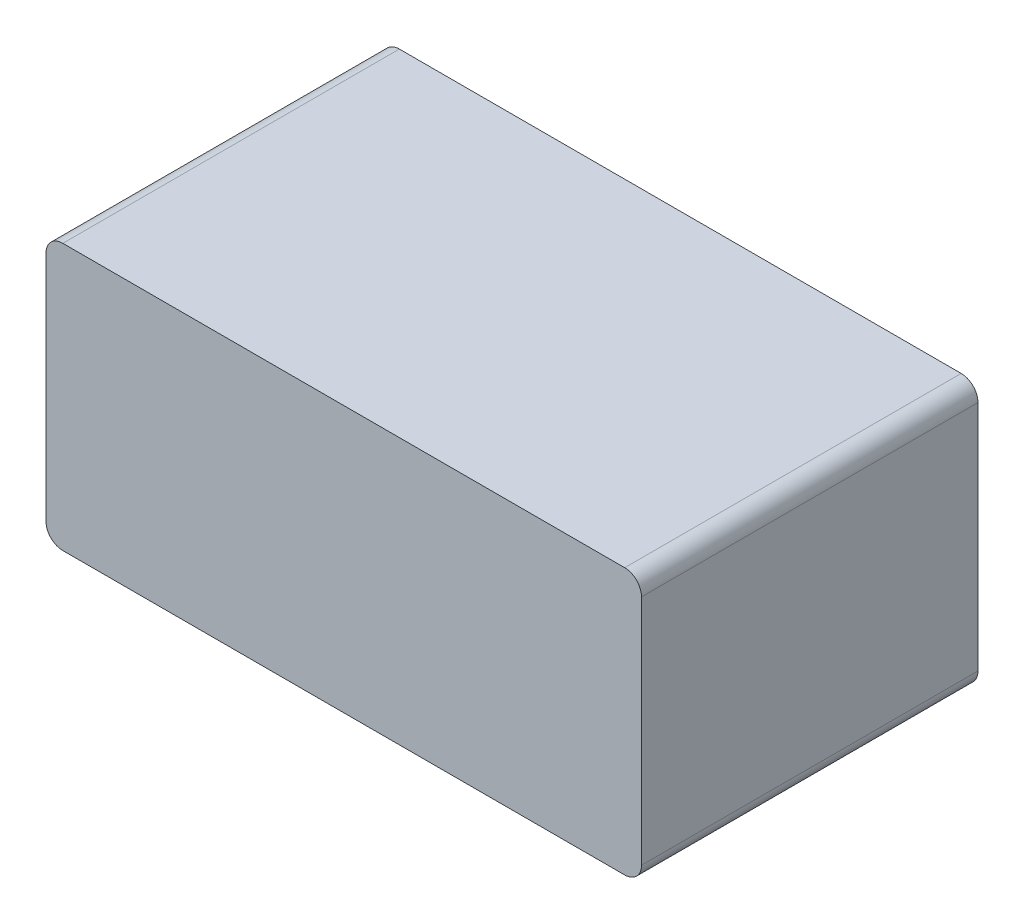
ISO-10303-21;
HEADER;
FILE_DESCRIPTION(('STEP AP214'),'2;1');
FILE_NAME('part.step','',(''),(''),'','','');
FILE_SCHEMA(('AUTOMOTIVE_DESIGN { 1 0 10303 214 1 1 1 1 }'));
ENDSEC;
DATA;
#1=APPLICATION_CONTEXT('core data for automotive mechanical design processes');
#2=APPLICATION_PROTOCOL_DEFINITION('international standard','automotive_design',2000,#1);
#3=PRODUCT_CONTEXT('',#1,'mechanical');
#4=PRODUCT('Part','Part','',(#3));
#5=PRODUCT_RELATED_PRODUCT_CATEGORY('part','',(#4));
#6=PRODUCT_DEFINITION_FORMATION('','',#4);
#7=PRODUCT_DEFINITION_CONTEXT('part definition',#1,'design');
#8=PRODUCT_DEFINITION('design','',#6,#7);
#9=PRODUCT_DEFINITION_SHAPE('','',#8);
#10=(LENGTH_UNIT() NAMED_UNIT(*) SI_UNIT(.MILLI.,.METRE.));
#11=(NAMED_UNIT(*) PLANE_ANGLE_UNIT() SI_UNIT($,.RADIAN.));
#12=(NAMED_UNIT(*) SI_UNIT($,.STERADIAN.) SOLID_ANGLE_UNIT());
#13=UNCERTAINTY_MEASURE_WITH_UNIT(LENGTH_MEASURE(1.E-05),#10,'distance_accuracy_value','');
#14=(GEOMETRIC_REPRESENTATION_CONTEXT(3) GLOBAL_UNCERTAINTY_ASSIGNED_CONTEXT((#13)) GLOBAL_UNIT_ASSIGNED_CONTEXT((#10,
#11,#12)) REPRESENTATION_CONTEXT('',''));
#15=CARTESIAN_POINT('',(0.,0.,0.));
#16=DIRECTION('',(0.,0.,1.));
#17=DIRECTION('',(1.,0.,0.));
#18=AXIS2_PLACEMENT_3D('',#15,#16,#17);
#19=CARTESIAN_POINT('',(4.20867890266327,-12.9475380060647,-2.));
#20=DIRECTION('',(0.,0.,1.));
#21=DIRECTION('',(1.,0.,0.));
#22=AXIS2_PLACEMENT_3D('',#19,#20,#21);
#23=CYLINDRICAL_SURFACE('',#22,0.0999999999999994);
#24=CARTESIAN_POINT('',(4.20867890266327,-12.9475380060647,-2.));
#25=DIRECTION('',(0.,0.,1.));
#26=DIRECTION('',(1.,0.,0.));
#27=AXIS2_PLACEMENT_3D('',#24,#25,#26);
#28=CIRCLE('',#27,0.0999999999999994);
#29=CARTESIAN_POINT('',(4.20867890266327,-13.0475380060647,-2.));
#30=VERTEX_POINT('',#29);
#31=CARTESIAN_POINT('',(4.30867890266327,-12.9475380060647,-2.));
#32=VERTEX_POINT('',#31);
#33=EDGE_CURVE('E88',#30,#32,#28,.T.);
#34=ORIENTED_EDGE('',*,*,#33,.T.);
#35=DIRECTION('',(0.,0.,-1.));
#36=VECTOR('',#35,1.);
#37=CARTESIAN_POINT('',(4.30867890266327,-12.9475380060647,-2.));
#38=LINE('',#37,#36);
#39=CARTESIAN_POINT('',(4.30867890266327,-12.9475380060647,0.));
#40=VERTEX_POINT('',#39);
#41=EDGE_CURVE('E86',#40,#32,#38,.T.);
#42=ORIENTED_EDGE('',*,*,#41,.F.);
#43=CARTESIAN_POINT('',(4.20867890266327,-12.9475380060647,0.));
#44=DIRECTION('',(0.,0.,1.));
#45=DIRECTION('',(1.,0.,0.));
#46=AXIS2_PLACEMENT_3D('',#43,#44,#45);
#47=CIRCLE('',#46,0.0999999999999994);
#48=CARTESIAN_POINT('',(4.20867890266327,-13.0475380060647,0.));
#49=VERTEX_POINT('',#48);
#50=EDGE_CURVE('E20',#40,#49,#47,.F.);
#51=ORIENTED_EDGE('',*,*,#50,.T.);
#52=DIRECTION('',(0.,0.,-1.));
#53=VECTOR('',#52,1.);
#54=CARTESIAN_POINT('',(4.20867890266327,-13.0475380060647,-2.));
#55=LINE('',#54,#53);
#56=EDGE_CURVE('E83',#30,#49,#55,.F.);
#57=ORIENTED_EDGE('',*,*,#56,.F.);
#58=EDGE_LOOP('',(#34,#42,#51,#57));
#59=FACE_BOUND('',#58,.T.);
#60=ADVANCED_FACE('F17',(#59),#23,.T.);
#61=CARTESIAN_POINT('',(0.869281225246835,-12.9475380060647,-2.));
#62=DIRECTION('',(0.,0.,1.));
#63=DIRECTION('',(1.,0.,0.));
#64=AXIS2_PLACEMENT_3D('',#61,#62,#63);
#65=CYLINDRICAL_SURFACE('',#64,0.0999999999999994);
#66=CARTESIAN_POINT('',(0.869281225246835,-12.9475380060647,-2.));
#67=DIRECTION('',(0.,0.,1.));
#68=DIRECTION('',(1.,0.,0.));
#69=AXIS2_PLACEMENT_3D('',#66,#67,#68);
#70=CIRCLE('',#69,0.0999999999999994);
#71=CARTESIAN_POINT('',(0.769281225246835,-12.9475380060647,-2.));
#72=VERTEX_POINT('',#71);
#73=CARTESIAN_POINT('',(0.869281225246835,-13.0475380060647,-2.));
#74=VERTEX_POINT('',#73);
#75=EDGE_CURVE('E127',#72,#74,#70,.T.);
#76=ORIENTED_EDGE('',*,*,#75,.T.);
#77=DIRECTION('',(0.,0.,-1.));
#78=VECTOR('',#77,1.);
#79=CARTESIAN_POINT('',(0.869281225246836,-13.0475380060647,-2.));
#80=LINE('',#79,#78);
#81=CARTESIAN_POINT('',(0.869281225246835,-13.0475380060647,0.));
#82=VERTEX_POINT('',#81);
#83=EDGE_CURVE('E97',#82,#74,#80,.T.);
#84=ORIENTED_EDGE('',*,*,#83,.F.);
#85=CARTESIAN_POINT('',(0.869281225246835,-12.9475380060647,0.));
#86=DIRECTION('',(0.,0.,1.));
#87=DIRECTION('',(1.,0.,0.));
#88=AXIS2_PLACEMENT_3D('',#85,#86,#87);
#89=CIRCLE('',#88,0.0999999999999994);
#90=CARTESIAN_POINT('',(0.769281225246835,-12.9475380060647,0.));
#91=VERTEX_POINT('',#90);
#92=EDGE_CURVE('E101',#82,#91,#89,.F.);
#93=ORIENTED_EDGE('',*,*,#92,.T.);
#94=DIRECTION('',(0.,0.,1.));
#95=VECTOR('',#94,1.);
#96=CARTESIAN_POINT('',(0.769281225246835,-12.9475380060647,-2.));
#97=LINE('',#96,#95);
#98=EDGE_CURVE('E96',#72,#91,#97,.T.);
#99=ORIENTED_EDGE('',*,*,#98,.F.);
#100=EDGE_LOOP('',(#76,#84,#93,#99));
#101=FACE_BOUND('',#100,.T.);
#102=ADVANCED_FACE('F160',(#101),#65,.T.);
#103=CARTESIAN_POINT('',(4.30867890266327,-11.5659567604475,-2.));
#104=DIRECTION('',(1.,0.,0.));
#105=DIRECTION('',(0.,0.,-1.));
#106=AXIS2_PLACEMENT_3D('',#103,#104,#105);
#107=PLANE('',#106);
#108=DIRECTION('',(0.,1.,0.));
#109=VECTOR('',#108,1.);
#110=CARTESIAN_POINT('',(4.30867890266327,-11.5659567604475,-2.));
#111=LINE('',#110,#109);
#112=CARTESIAN_POINT('',(4.30867890266327,-11.5659567604475,-2.));
#113=VERTEX_POINT('',#112);
#114=EDGE_CURVE('E118',#32,#113,#111,.T.);
#115=ORIENTED_EDGE('',*,*,#114,.T.);
#116=DIRECTION('',(0.,0.,1.));
#117=VECTOR('',#116,1.);
#118=CARTESIAN_POINT('',(4.30867890266327,-11.5659567604475,-2.));
#119=LINE('',#118,#117);
#120=CARTESIAN_POINT('',(4.30867890266327,-11.5659567604475,0.));
#121=VERTEX_POINT('',#120);
#122=EDGE_CURVE('E107',#121,#113,#119,.F.);
#123=ORIENTED_EDGE('',*,*,#122,.F.);
#124=DIRECTION('',(0.,1.,0.));
#125=VECTOR('',#124,1.);
#126=CARTESIAN_POINT('',(4.30867890266327,-12.9475380060647,0.));
#127=LINE('',#126,#125);
#128=EDGE_CURVE('E109',#40,#121,#127,.T.);
#129=ORIENTED_EDGE('',*,*,#128,.F.);
#130=ORIENTED_EDGE('',*,*,#41,.T.);
#131=EDGE_LOOP('',(#115,#123,#129,#130));
#132=FACE_BOUND('',#131,.T.);
#133=ADVANCED_FACE('F140',(#132),#107,.T.);
#134=CARTESIAN_POINT('',(4.20867890266327,-13.0475380060647,-2.));
#135=DIRECTION('',(0.,-1.,0.));
#136=DIRECTION('',(0.,0.,-1.));
#137=AXIS2_PLACEMENT_3D('',#134,#135,#136);
#138=PLANE('',#137);
#139=DIRECTION('',(1.,0.,0.));
#140=VECTOR('',#139,1.);
#141=CARTESIAN_POINT('',(4.20867890266327,-13.0475380060647,-2.));
#142=LINE('',#141,#140);
#143=EDGE_CURVE('E95',#74,#30,#142,.T.);
#144=ORIENTED_EDGE('',*,*,#143,.T.);
#145=ORIENTED_EDGE('',*,*,#56,.T.);
#146=DIRECTION('',(1.,0.,0.));
#147=VECTOR('',#146,1.);
#148=CARTESIAN_POINT('',(4.20867890266327,-13.0475380060647,0.));
#149=LINE('',#148,#147);
#150=EDGE_CURVE('E93',#82,#49,#149,.T.);
#151=ORIENTED_EDGE('',*,*,#150,.F.);
#152=ORIENTED_EDGE('',*,*,#83,.T.);
#153=EDGE_LOOP('',(#144,#145,#151,#152));
#154=FACE_BOUND('',#153,.T.);
#155=ADVANCED_FACE('F91',(#154),#138,.T.);
#156=CARTESIAN_POINT('',(0.769281225246835,-11.5659567604475,-2.));
#157=DIRECTION('',(-1.,0.,0.));
#158=DIRECTION('',(0.,0.,1.));
#159=AXIS2_PLACEMENT_3D('',#156,#157,#158);
#160=PLANE('',#159);
#161=DIRECTION('',(0.,1.,0.));
#162=VECTOR('',#161,1.);
#163=CARTESIAN_POINT('',(0.769281225246835,-12.9475380060647,-2.));
#164=LINE('',#163,#162);
#165=CARTESIAN_POINT('',(0.769281225246835,-11.5659567604475,-2.));
#166=VERTEX_POINT('',#165);
#167=EDGE_CURVE('E132',#166,#72,#164,.F.);
#168=ORIENTED_EDGE('',*,*,#167,.T.);
#169=ORIENTED_EDGE('',*,*,#98,.T.);
#170=DIRECTION('',(0.,1.,0.));
#171=VECTOR('',#170,1.);
#172=CARTESIAN_POINT('',(0.769281225246835,-12.9475380060647,0.));
#173=LINE('',#172,#171);
#174=CARTESIAN_POINT('',(0.769281225246835,-11.5659567604475,0.));
#175=VERTEX_POINT('',#174);
#176=EDGE_CURVE('E104',#175,#91,#173,.F.);
#177=ORIENTED_EDGE('',*,*,#176,.F.);
#178=DIRECTION('',(0.,0.,1.));
#179=VECTOR('',#178,1.);
#180=CARTESIAN_POINT('',(0.769281225246836,-11.5659567604475,-2.));
#181=LINE('',#180,#179);
#182=EDGE_CURVE('E115',#166,#175,#181,.T.);
#183=ORIENTED_EDGE('',*,*,#182,.F.);
#184=EDGE_LOOP('',(#168,#169,#177,#183));
#185=FACE_BOUND('',#184,.T.);
#186=ADVANCED_FACE('F157',(#185),#160,.T.);
#187=CARTESIAN_POINT('',(4.20867890266327,-12.9475380060647,0.));
#188=DIRECTION('',(0.,0.,1.));
#189=DIRECTION('',(1.,0.,0.));
#190=AXIS2_PLACEMENT_3D('',#187,#188,#189);
#191=PLANE('',#190);
#192=ORIENTED_EDGE('',*,*,#92,.F.);
#193=ORIENTED_EDGE('',*,*,#150,.T.);
#194=ORIENTED_EDGE('',*,*,#50,.F.);
#195=ORIENTED_EDGE('',*,*,#128,.T.);
#196=CARTESIAN_POINT('',(4.20867890266327,-11.5659567604475,0.));
#197=DIRECTION('',(0.,0.,1.));
#198=DIRECTION('',(1.,0.,0.));
#199=AXIS2_PLACEMENT_3D('',#196,#197,#198);
#200=CIRCLE('',#199,0.0999999999999994);
#201=CARTESIAN_POINT('',(4.20867890266327,-11.4659567604475,0.));
#202=VERTEX_POINT('',#201);
#203=EDGE_CURVE('E103',#202,#121,#200,.F.);
#204=ORIENTED_EDGE('',*,*,#203,.F.);
#205=DIRECTION('',(1.,0.,0.));
#206=VECTOR('',#205,1.);
#207=CARTESIAN_POINT('',(4.20867890266327,-11.4659567604475,0.));
#208=LINE('',#207,#206);
#209=CARTESIAN_POINT('',(0.869281225246835,-11.4659567604475,0.));
#210=VERTEX_POINT('',#209);
#211=EDGE_CURVE('E112',#210,#202,#208,.T.);
#212=ORIENTED_EDGE('',*,*,#211,.F.);
#213=CARTESIAN_POINT('',(0.869281225246835,-11.5659567604475,0.));
#214=DIRECTION('',(0.,0.,1.));
#215=DIRECTION('',(1.,0.,0.));
#216=AXIS2_PLACEMENT_3D('',#213,#214,#215);
#217=CIRCLE('',#216,0.0999999999999994);
#218=EDGE_CURVE('E129',#175,#210,#217,.F.);
#219=ORIENTED_EDGE('',*,*,#218,.F.);
#220=ORIENTED_EDGE('',*,*,#176,.T.);
#221=EDGE_LOOP('',(#192,#193,#194,#195,#204,#212,#219,#220));
#222=FACE_BOUND('',#221,.T.);
#223=ADVANCED_FACE('F99',(#222),#191,.T.);
#224=CARTESIAN_POINT('',(4.20867890266327,-11.5659567604475,-2.));
#225=DIRECTION('',(0.,0.,1.));
#226=DIRECTION('',(1.,0.,0.));
#227=AXIS2_PLACEMENT_3D('',#224,#225,#226);
#228=CYLINDRICAL_SURFACE('',#227,0.0999999999999994);
#229=CARTESIAN_POINT('',(4.20867890266327,-11.5659567604475,-2.));
#230=DIRECTION('',(0.,0.,1.));
#231=DIRECTION('',(1.,0.,0.));
#232=AXIS2_PLACEMENT_3D('',#229,#230,#231);
#233=CIRCLE('',#232,0.0999999999999994);
#234=CARTESIAN_POINT('',(4.20867890266327,-11.4659567604475,-2.));
#235=VERTEX_POINT('',#234);
#236=EDGE_CURVE('E124',#113,#235,#233,.T.);
#237=ORIENTED_EDGE('',*,*,#236,.T.);
#238=DIRECTION('',(0.,0.,1.));
#239=VECTOR('',#238,1.);
#240=CARTESIAN_POINT('',(4.20867890266327,-11.4659567604475,-2.));
#241=LINE('',#240,#239);
#242=EDGE_CURVE('E146',#202,#235,#241,.F.);
#243=ORIENTED_EDGE('',*,*,#242,.F.);
#244=ORIENTED_EDGE('',*,*,#203,.T.);
#245=ORIENTED_EDGE('',*,*,#122,.T.);
#246=EDGE_LOOP('',(#237,#243,#244,#245));
#247=FACE_BOUND('',#246,.T.);
#248=ADVANCED_FACE('F147',(#247),#228,.T.);
#249=CARTESIAN_POINT('',(4.20867890266327,-12.9475380060647,-2.));
#250=DIRECTION('',(0.,0.,1.));
#251=DIRECTION('',(1.,0.,0.));
#252=AXIS2_PLACEMENT_3D('',#249,#250,#251);
#253=PLANE('',#252);
#254=ORIENTED_EDGE('',*,*,#143,.F.);
#255=ORIENTED_EDGE('',*,*,#75,.F.);
#256=ORIENTED_EDGE('',*,*,#167,.F.);
#257=CARTESIAN_POINT('',(0.869281225246835,-11.5659567604475,-2.));
#258=DIRECTION('',(0.,0.,1.));
#259=DIRECTION('',(1.,0.,0.));
#260=AXIS2_PLACEMENT_3D('',#257,#258,#259);
#261=CIRCLE('',#260,0.0999999999999994);
#262=CARTESIAN_POINT('',(0.869281225246835,-11.4659567604475,-2.));
#263=VERTEX_POINT('',#262);
#264=EDGE_CURVE('E35',#263,#166,#261,.T.);
#265=ORIENTED_EDGE('',*,*,#264,.F.);
#266=DIRECTION('',(1.,0.,0.));
#267=VECTOR('',#266,1.);
#268=CARTESIAN_POINT('',(4.20867890266327,-11.4659567604475,-2.));
#269=LINE('',#268,#267);
#270=EDGE_CURVE('E26',#235,#263,#269,.F.);
#271=ORIENTED_EDGE('',*,*,#270,.F.);
#272=ORIENTED_EDGE('',*,*,#236,.F.);
#273=ORIENTED_EDGE('',*,*,#114,.F.);
#274=ORIENTED_EDGE('',*,*,#33,.F.);
#275=EDGE_LOOP('',(#254,#255,#256,#265,#271,#272,#273,#274));
#276=FACE_BOUND('',#275,.T.);
#277=ADVANCED_FACE('F137',(#276),#253,.F.);
#278=CARTESIAN_POINT('',(0.869281225246835,-11.5659567604475,-2.));
#279=DIRECTION('',(0.,0.,1.));
#280=DIRECTION('',(1.,0.,0.));
#281=AXIS2_PLACEMENT_3D('',#278,#279,#280);
#282=CYLINDRICAL_SURFACE('',#281,0.0999999999999994);
#283=ORIENTED_EDGE('',*,*,#264,.T.);
#284=ORIENTED_EDGE('',*,*,#182,.T.);
#285=ORIENTED_EDGE('',*,*,#218,.T.);
#286=DIRECTION('',(0.,0.,1.));
#287=VECTOR('',#286,1.);
#288=CARTESIAN_POINT('',(0.869281225246836,-11.4659567604475,-2.));
#289=LINE('',#288,#287);
#290=EDGE_CURVE('E11',#263,#210,#289,.T.);
#291=ORIENTED_EDGE('',*,*,#290,.F.);
#292=EDGE_LOOP('',(#283,#284,#285,#291));
#293=FACE_BOUND('',#292,.T.);
#294=ADVANCED_FACE('F153',(#293),#282,.T.);
#295=CARTESIAN_POINT('',(4.20867890266327,-11.4659567604475,-2.));
#296=DIRECTION('',(0.,1.,0.));
#297=DIRECTION('',(0.,0.,1.));
#298=AXIS2_PLACEMENT_3D('',#295,#296,#297);
#299=PLANE('',#298);
#300=ORIENTED_EDGE('',*,*,#270,.T.);
#301=ORIENTED_EDGE('',*,*,#290,.T.);
#302=ORIENTED_EDGE('',*,*,#211,.T.);
#303=ORIENTED_EDGE('',*,*,#242,.T.);
#304=EDGE_LOOP('',(#300,#301,#302,#303));
#305=FACE_BOUND('',#304,.T.);
#306=ADVANCED_FACE('F151',(#305),#299,.T.);
#307=CLOSED_SHELL('',(#60,#102,#133,#155,#186,#223,#248,#277,#294,#306));
#308=MANIFOLD_SOLID_BREP('B1',#307);
#309=ADVANCED_BREP_SHAPE_REPRESENTATION('',(#18,#308),#14);
#310=SHAPE_DEFINITION_REPRESENTATION(#9,#309);
ENDSEC;
END-ISO-10303-21;
